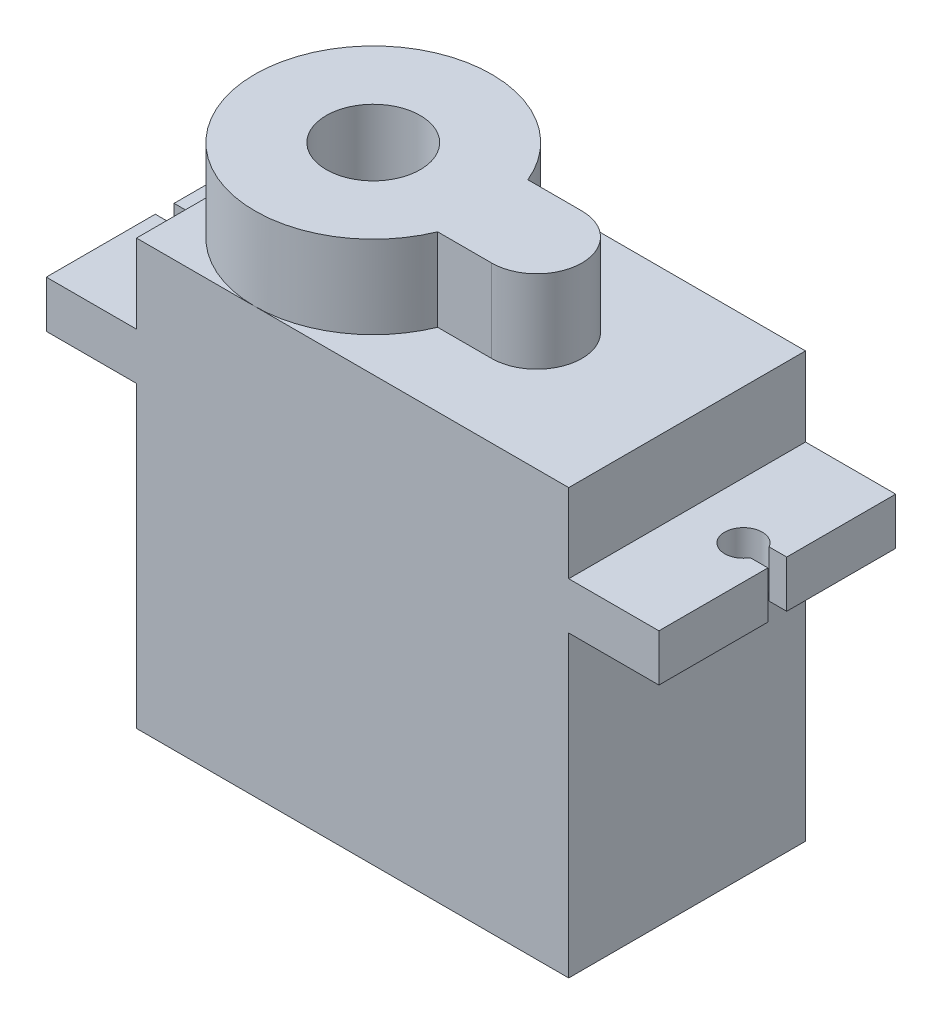
ISO-10303-21;
HEADER;
FILE_DESCRIPTION(('STEP AP214'),'2;1');
FILE_NAME('part.step','',(''),(''),'','','');
FILE_SCHEMA(('AUTOMOTIVE_DESIGN { 1 0 10303 214 1 1 1 1 }'));
ENDSEC;
DATA;
#1=APPLICATION_CONTEXT('core data for automotive mechanical design processes');
#2=APPLICATION_PROTOCOL_DEFINITION('international standard','automotive_design',2000,#1);
#3=PRODUCT_CONTEXT('',#1,'mechanical');
#4=PRODUCT('Part','Part','',(#3));
#5=PRODUCT_RELATED_PRODUCT_CATEGORY('part','',(#4));
#6=PRODUCT_DEFINITION_FORMATION('','',#4);
#7=PRODUCT_DEFINITION_CONTEXT('part definition',#1,'design');
#8=PRODUCT_DEFINITION('design','',#6,#7);
#9=PRODUCT_DEFINITION_SHAPE('','',#8);
#10=(LENGTH_UNIT() NAMED_UNIT(*) SI_UNIT(.MILLI.,.METRE.));
#11=(NAMED_UNIT(*) PLANE_ANGLE_UNIT() SI_UNIT($,.RADIAN.));
#12=(NAMED_UNIT(*) SI_UNIT($,.STERADIAN.) SOLID_ANGLE_UNIT());
#13=UNCERTAINTY_MEASURE_WITH_UNIT(LENGTH_MEASURE(1.E-05),#10,'distance_accuracy_value','');
#14=(GEOMETRIC_REPRESENTATION_CONTEXT(3) GLOBAL_UNCERTAINTY_ASSIGNED_CONTEXT((#13)) GLOBAL_UNIT_ASSIGNED_CONTEXT((#10,
#11,#12)) REPRESENTATION_CONTEXT('',''));
#15=CARTESIAN_POINT('',(0.,0.,0.));
#16=DIRECTION('',(0.,0.,1.));
#17=DIRECTION('',(1.,0.,0.));
#18=AXIS2_PLACEMENT_3D('',#15,#16,#17);
#19=CARTESIAN_POINT('',(-11.5,22.6,12.6));
#20=DIRECTION('',(0.,1.,0.));
#21=DIRECTION('',(0.,0.,1.));
#22=AXIS2_PLACEMENT_3D('',#19,#20,#21);
#23=PLANE('',#22);
#24=CARTESIAN_POINT('',(-5.2,22.6,6.3));
#25=DIRECTION('',(0.,1.,0.));
#26=DIRECTION('',(0.,0.,1.));
#27=AXIS2_PLACEMENT_3D('',#24,#25,#26);
#28=CIRCLE('',#27,6.3);
#29=CARTESIAN_POINT('',(0.624946351684278,22.6,3.9));
#30=VERTEX_POINT('',#29);
#31=CARTESIAN_POINT('',(-5.2,22.6,0.));
#32=VERTEX_POINT('',#31);
#33=EDGE_CURVE('E47',#30,#32,#28,.T.);
#34=ORIENTED_EDGE('',*,*,#33,.F.);
#35=DIRECTION('',(1.,0.,0.));
#36=VECTOR('',#35,1.);
#37=CARTESIAN_POINT('',(0.,22.6,3.9));
#38=LINE('',#37,#36);
#39=CARTESIAN_POINT('',(3.5,22.6,3.9));
#40=VERTEX_POINT('',#39);
#41=EDGE_CURVE('E58',#30,#40,#38,.T.);
#42=ORIENTED_EDGE('',*,*,#41,.T.);
#43=CARTESIAN_POINT('',(3.5,22.6,6.3));
#44=DIRECTION('',(0.,1.,0.));
#45=DIRECTION('',(0.,0.,1.));
#46=AXIS2_PLACEMENT_3D('',#43,#44,#45);
#47=CIRCLE('',#46,2.4);
#48=CARTESIAN_POINT('',(3.5,22.6,8.7));
#49=VERTEX_POINT('',#48);
#50=EDGE_CURVE('E444',#49,#40,#47,.T.);
#51=ORIENTED_EDGE('',*,*,#50,.F.);
#52=DIRECTION('',(1.,0.,0.));
#53=VECTOR('',#52,1.);
#54=CARTESIAN_POINT('',(0.,22.6,8.7));
#55=LINE('',#54,#53);
#56=CARTESIAN_POINT('',(0.624946351684278,22.6,8.7));
#57=VERTEX_POINT('',#56);
#58=EDGE_CURVE('E443',#57,#49,#55,.T.);
#59=ORIENTED_EDGE('',*,*,#58,.F.);
#60=CARTESIAN_POINT('',(-5.2,22.6,12.6));
#61=VERTEX_POINT('',#60);
#62=EDGE_CURVE('E233',#61,#57,#28,.T.);
#63=ORIENTED_EDGE('',*,*,#62,.F.);
#64=DIRECTION('',(1.,0.,0.));
#65=VECTOR('',#64,1.);
#66=CARTESIAN_POINT('',(-11.5,22.6,12.6));
#67=LINE('',#66,#65);
#68=CARTESIAN_POINT('',(11.5,22.6,12.6));
#69=VERTEX_POINT('',#68);
#70=EDGE_CURVE('E311',#61,#69,#67,.T.);
#71=ORIENTED_EDGE('',*,*,#70,.T.);
#72=DIRECTION('',(0.,0.,-1.));
#73=VECTOR('',#72,1.);
#74=CARTESIAN_POINT('',(11.5,22.6,12.6));
#75=LINE('',#74,#73);
#76=CARTESIAN_POINT('',(11.5,22.6,0.));
#77=VERTEX_POINT('',#76);
#78=EDGE_CURVE('E375',#69,#77,#75,.T.);
#79=ORIENTED_EDGE('',*,*,#78,.T.);
#80=DIRECTION('',(1.,0.,0.));
#81=VECTOR('',#80,1.);
#82=CARTESIAN_POINT('',(-11.5,22.6,0.));
#83=LINE('',#82,#81);
#84=EDGE_CURVE('E343',#32,#77,#83,.T.);
#85=ORIENTED_EDGE('',*,*,#84,.F.);
#86=EDGE_LOOP('',(#34,#42,#51,#59,#63,#71,#79,#85));
#87=FACE_BOUND('',#86,.T.);
#88=ADVANCED_FACE('F36',(#87),#23,.T.);
#89=CARTESIAN_POINT('',(-11.5,22.6,6.3));
#90=VERTEX_POINT('',#89);
#91=EDGE_CURVE('E11',#32,#90,#28,.T.);
#92=ORIENTED_EDGE('',*,*,#91,.F.);
#93=CARTESIAN_POINT('',(-11.5,22.6,0.));
#94=VERTEX_POINT('',#93);
#95=EDGE_CURVE('E344',#94,#32,#83,.T.);
#96=ORIENTED_EDGE('',*,*,#95,.F.);
#97=DIRECTION('',(0.,0.,-1.));
#98=VECTOR('',#97,1.);
#99=CARTESIAN_POINT('',(-11.5,22.6,12.6));
#100=LINE('',#99,#98);
#101=EDGE_CURVE('E381',#90,#94,#100,.T.);
#102=ORIENTED_EDGE('',*,*,#101,.F.);
#103=EDGE_LOOP('',(#92,#96,#102));
#104=FACE_BOUND('',#103,.T.);
#105=ADVANCED_FACE('F450',(#104),#23,.T.);
#106=CARTESIAN_POINT('',(-16.3,18.4,12.6));
#107=DIRECTION('',(0.,1.,0.));
#108=DIRECTION('',(0.,0.,1.));
#109=AXIS2_PLACEMENT_3D('',#106,#107,#108);
#110=PLANE('',#109);
#111=DIRECTION('',(1.,0.,0.));
#112=VECTOR('',#111,1.);
#113=CARTESIAN_POINT('',(0.,18.4,6.8));
#114=LINE('',#113,#112);
#115=CARTESIAN_POINT('',(-16.3,18.4,6.8));
#116=VERTEX_POINT('',#115);
#117=CARTESIAN_POINT('',(-15.3660254037844,18.4,6.8));
#118=VERTEX_POINT('',#117);
#119=EDGE_CURVE('E234',#116,#118,#114,.T.);
#120=ORIENTED_EDGE('',*,*,#119,.F.);
#121=DIRECTION('',(0.,0.,-1.));
#122=VECTOR('',#121,1.);
#123=CARTESIAN_POINT('',(-16.3,18.4,12.6));
#124=LINE('',#123,#122);
#125=CARTESIAN_POINT('',(-16.3,18.4,12.6));
#126=VERTEX_POINT('',#125);
#127=EDGE_CURVE('E384',#126,#116,#124,.T.);
#128=ORIENTED_EDGE('',*,*,#127,.F.);
#129=DIRECTION('',(1.,0.,0.));
#130=VECTOR('',#129,1.);
#131=CARTESIAN_POINT('',(-16.3,18.4,12.6));
#132=LINE('',#131,#130);
#133=CARTESIAN_POINT('',(-11.5,18.4,12.6));
#134=VERTEX_POINT('',#133);
#135=EDGE_CURVE('E305',#126,#134,#132,.T.);
#136=ORIENTED_EDGE('',*,*,#135,.T.);
#137=DIRECTION('',(0.,0.,-1.));
#138=VECTOR('',#137,1.);
#139=CARTESIAN_POINT('',(-11.5,18.4,12.6));
#140=LINE('',#139,#138);
#141=CARTESIAN_POINT('',(-11.5,18.4,0.));
#142=VERTEX_POINT('',#141);
#143=EDGE_CURVE('E382',#134,#142,#140,.T.);
#144=ORIENTED_EDGE('',*,*,#143,.T.);
#145=DIRECTION('',(1.,0.,0.));
#146=VECTOR('',#145,1.);
#147=CARTESIAN_POINT('',(-16.3,18.4,0.));
#148=LINE('',#147,#146);
#149=CARTESIAN_POINT('',(-16.3,18.4,0.));
#150=VERTEX_POINT('',#149);
#151=EDGE_CURVE('E337',#150,#142,#148,.T.);
#152=ORIENTED_EDGE('',*,*,#151,.F.);
#153=CARTESIAN_POINT('',(-16.3,18.4,5.8));
#154=VERTEX_POINT('',#153);
#155=EDGE_CURVE('E387',#154,#150,#124,.T.);
#156=ORIENTED_EDGE('',*,*,#155,.F.);
#157=DIRECTION('',(1.,0.,0.));
#158=VECTOR('',#157,1.);
#159=CARTESIAN_POINT('',(0.,18.4,5.8));
#160=LINE('',#159,#158);
#161=CARTESIAN_POINT('',(-15.3660254037844,18.4,5.8));
#162=VERTEX_POINT('',#161);
#163=EDGE_CURVE('E247',#154,#162,#160,.T.);
#164=ORIENTED_EDGE('',*,*,#163,.T.);
#165=CARTESIAN_POINT('',(-14.5,18.4,6.3));
#166=DIRECTION('',(0.,1.,0.));
#167=DIRECTION('',(0.,0.,1.));
#168=AXIS2_PLACEMENT_3D('',#165,#166,#167);
#169=CIRCLE('',#168,1.);
#170=EDGE_CURVE('E237',#162,#118,#169,.F.);
#171=ORIENTED_EDGE('',*,*,#170,.T.);
#172=EDGE_LOOP('',(#120,#128,#136,#144,#152,#156,#164,#171));
#173=FACE_BOUND('',#172,.T.);
#174=ADVANCED_FACE('F433',(#173),#110,.T.);
#175=CARTESIAN_POINT('',(-16.3,15.9,12.6));
#176=DIRECTION('',(-1.,0.,0.));
#177=DIRECTION('',(0.,-1.,0.));
#178=AXIS2_PLACEMENT_3D('',#175,#176,#177);
#179=PLANE('',#178);
#180=DIRECTION('',(0.,0.,-1.));
#181=VECTOR('',#180,1.);
#182=CARTESIAN_POINT('',(-16.3,15.9,12.6));
#183=LINE('',#182,#181);
#184=CARTESIAN_POINT('',(-16.3,15.9,5.8));
#185=VERTEX_POINT('',#184);
#186=CARTESIAN_POINT('',(-16.3,15.9,0.));
#187=VERTEX_POINT('',#186);
#188=EDGE_CURVE('E390',#185,#187,#183,.T.);
#189=ORIENTED_EDGE('',*,*,#188,.F.);
#190=DIRECTION('',(0.,1.,0.));
#191=VECTOR('',#190,1.);
#192=CARTESIAN_POINT('',(-16.3,15.9,5.8));
#193=LINE('',#192,#191);
#194=EDGE_CURVE('E260',#185,#154,#193,.T.);
#195=ORIENTED_EDGE('',*,*,#194,.T.);
#196=ORIENTED_EDGE('',*,*,#155,.T.);
#197=DIRECTION('',(0.,1.,0.));
#198=VECTOR('',#197,1.);
#199=CARTESIAN_POINT('',(-16.3,15.9,0.));
#200=LINE('',#199,#198);
#201=EDGE_CURVE('E334',#187,#150,#200,.T.);
#202=ORIENTED_EDGE('',*,*,#201,.F.);
#203=EDGE_LOOP('',(#189,#195,#196,#202));
#204=FACE_BOUND('',#203,.T.);
#205=ADVANCED_FACE('F429',(#204),#179,.T.);
#206=CARTESIAN_POINT('',(-11.5,15.9,12.6));
#207=DIRECTION('',(0.,-1.,0.));
#208=DIRECTION('',(0.,0.,-1.));
#209=AXIS2_PLACEMENT_3D('',#206,#207,#208);
#210=PLANE('',#209);
#211=DIRECTION('',(1.,0.,0.));
#212=VECTOR('',#211,1.);
#213=CARTESIAN_POINT('',(0.,15.9,6.8));
#214=LINE('',#213,#212);
#215=CARTESIAN_POINT('',(-16.3,15.9,6.8));
#216=VERTEX_POINT('',#215);
#217=CARTESIAN_POINT('',(-15.3660254037844,15.9,6.8));
#218=VERTEX_POINT('',#217);
#219=EDGE_CURVE('E243',#216,#218,#214,.T.);
#220=ORIENTED_EDGE('',*,*,#219,.T.);
#221=CARTESIAN_POINT('',(-14.5,15.9,6.3));
#222=DIRECTION('',(0.,1.,0.));
#223=DIRECTION('',(0.,0.,1.));
#224=AXIS2_PLACEMENT_3D('',#221,#222,#223);
#225=CIRCLE('',#224,1.);
#226=CARTESIAN_POINT('',(-15.3660254037844,15.9,5.8));
#227=VERTEX_POINT('',#226);
#228=EDGE_CURVE('E246',#227,#218,#225,.F.);
#229=ORIENTED_EDGE('',*,*,#228,.F.);
#230=DIRECTION('',(1.,0.,0.));
#231=VECTOR('',#230,1.);
#232=CARTESIAN_POINT('',(0.,15.9,5.8));
#233=LINE('',#232,#231);
#234=EDGE_CURVE('E249',#185,#227,#233,.T.);
#235=ORIENTED_EDGE('',*,*,#234,.F.);
#236=ORIENTED_EDGE('',*,*,#188,.T.);
#237=DIRECTION('',(-1.,0.,0.));
#238=VECTOR('',#237,1.);
#239=CARTESIAN_POINT('',(-11.5,15.9,0.));
#240=LINE('',#239,#238);
#241=CARTESIAN_POINT('',(-11.5,15.9,0.));
#242=VERTEX_POINT('',#241);
#243=EDGE_CURVE('E331',#242,#187,#240,.T.);
#244=ORIENTED_EDGE('',*,*,#243,.F.);
#245=DIRECTION('',(0.,0.,-1.));
#246=VECTOR('',#245,1.);
#247=CARTESIAN_POINT('',(-11.5,15.9,12.6));
#248=LINE('',#247,#246);
#249=CARTESIAN_POINT('',(-11.5,15.9,12.6));
#250=VERTEX_POINT('',#249);
#251=EDGE_CURVE('E391',#250,#242,#248,.T.);
#252=ORIENTED_EDGE('',*,*,#251,.F.);
#253=DIRECTION('',(-1.,0.,0.));
#254=VECTOR('',#253,1.);
#255=CARTESIAN_POINT('',(-11.5,15.9,12.6));
#256=LINE('',#255,#254);
#257=CARTESIAN_POINT('',(-16.3,15.9,12.6));
#258=VERTEX_POINT('',#257);
#259=EDGE_CURVE('E299',#250,#258,#256,.T.);
#260=ORIENTED_EDGE('',*,*,#259,.T.);
#261=EDGE_CURVE('E388',#258,#216,#183,.T.);
#262=ORIENTED_EDGE('',*,*,#261,.T.);
#263=EDGE_LOOP('',(#220,#229,#235,#236,#244,#252,#260,#262));
#264=FACE_BOUND('',#263,.T.);
#265=ADVANCED_FACE('F423',(#264),#210,.T.);
#266=CARTESIAN_POINT('',(16.3,15.9,12.6));
#267=DIRECTION('',(-1.,0.,0.));
#268=DIRECTION('',(0.,-1.,0.));
#269=AXIS2_PLACEMENT_3D('',#266,#267,#268);
#270=PLANE('',#269);
#271=DIRECTION('',(0.,1.,0.));
#272=VECTOR('',#271,1.);
#273=CARTESIAN_POINT('',(16.3,15.9,6.8));
#274=LINE('',#273,#272);
#275=CARTESIAN_POINT('',(16.3,15.9,6.8));
#276=VERTEX_POINT('',#275);
#277=CARTESIAN_POINT('',(16.3,18.4,6.8));
#278=VERTEX_POINT('',#277);
#279=EDGE_CURVE('E285',#276,#278,#274,.T.);
#280=ORIENTED_EDGE('',*,*,#279,.T.);
#281=DIRECTION('',(0.,0.,-1.));
#282=VECTOR('',#281,1.);
#283=CARTESIAN_POINT('',(16.3,18.4,12.6));
#284=LINE('',#283,#282);
#285=CARTESIAN_POINT('',(16.3,18.4,12.6));
#286=VERTEX_POINT('',#285);
#287=EDGE_CURVE('E368',#286,#278,#284,.T.);
#288=ORIENTED_EDGE('',*,*,#287,.F.);
#289=DIRECTION('',(0.,1.,0.));
#290=VECTOR('',#289,1.);
#291=CARTESIAN_POINT('',(16.3,15.9,12.6));
#292=LINE('',#291,#290);
#293=CARTESIAN_POINT('',(16.3,15.9,12.6));
#294=VERTEX_POINT('',#293);
#295=EDGE_CURVE('E320',#294,#286,#292,.T.);
#296=ORIENTED_EDGE('',*,*,#295,.F.);
#297=DIRECTION('',(0.,0.,-1.));
#298=VECTOR('',#297,1.);
#299=CARTESIAN_POINT('',(16.3,15.9,12.6));
#300=LINE('',#299,#298);
#301=EDGE_CURVE('E364',#294,#276,#300,.T.);
#302=ORIENTED_EDGE('',*,*,#301,.T.);
#303=EDGE_LOOP('',(#280,#288,#296,#302));
#304=FACE_BOUND('',#303,.T.);
#305=ADVANCED_FACE('F654',(#304),#270,.F.);
#306=CARTESIAN_POINT('',(11.5,0.,12.6));
#307=DIRECTION('',(0.,-1.,0.));
#308=DIRECTION('',(0.,0.,-1.));
#309=AXIS2_PLACEMENT_3D('',#306,#307,#308);
#310=PLANE('',#309);
#311=DIRECTION('',(-1.,0.,0.));
#312=VECTOR('',#311,1.);
#313=CARTESIAN_POINT('',(11.5,0.,0.));
#314=LINE('',#313,#312);
#315=CARTESIAN_POINT('',(11.5,0.,0.));
#316=VERTEX_POINT('',#315);
#317=CARTESIAN_POINT('',(-11.5,0.,0.));
#318=VERTEX_POINT('',#317);
#319=EDGE_CURVE('E284',#316,#318,#314,.T.);
#320=ORIENTED_EDGE('',*,*,#319,.F.);
#321=DIRECTION('',(0.,0.,-1.));
#322=VECTOR('',#321,1.);
#323=CARTESIAN_POINT('',(11.5,0.,12.6));
#324=LINE('',#323,#322);
#325=CARTESIAN_POINT('',(11.5,0.,12.6));
#326=VERTEX_POINT('',#325);
#327=EDGE_CURVE('E359',#326,#316,#324,.T.);
#328=ORIENTED_EDGE('',*,*,#327,.F.);
#329=DIRECTION('',(-1.,0.,0.));
#330=VECTOR('',#329,1.);
#331=CARTESIAN_POINT('',(11.5,0.,12.6));
#332=LINE('',#331,#330);
#333=CARTESIAN_POINT('',(-11.5,0.,12.6));
#334=VERTEX_POINT('',#333);
#335=EDGE_CURVE('E292',#326,#334,#332,.T.);
#336=ORIENTED_EDGE('',*,*,#335,.T.);
#337=DIRECTION('',(0.,0.,-1.));
#338=VECTOR('',#337,1.);
#339=CARTESIAN_POINT('',(-11.5,0.,12.6));
#340=LINE('',#339,#338);
#341=EDGE_CURVE('E40',#334,#318,#340,.T.);
#342=ORIENTED_EDGE('',*,*,#341,.T.);
#343=EDGE_LOOP('',(#320,#328,#336,#342));
#344=FACE_BOUND('',#343,.T.);
#345=ADVANCED_FACE('F38',(#344),#310,.T.);
#346=CARTESIAN_POINT('',(11.5,0.,12.6));
#347=DIRECTION('',(-1.,0.,0.));
#348=DIRECTION('',(0.,0.,1.));
#349=AXIS2_PLACEMENT_3D('',#346,#347,#348);
#350=PLANE('',#349);
#351=DIRECTION('',(0.,1.,0.));
#352=VECTOR('',#351,1.);
#353=CARTESIAN_POINT('',(11.5,0.,0.));
#354=LINE('',#353,#352);
#355=CARTESIAN_POINT('',(11.5,15.9,0.));
#356=VERTEX_POINT('',#355);
#357=EDGE_CURVE('E296',#316,#356,#354,.T.);
#358=ORIENTED_EDGE('',*,*,#357,.T.);
#359=DIRECTION('',(0.,0.,-1.));
#360=VECTOR('',#359,1.);
#361=CARTESIAN_POINT('',(11.5,15.9,12.6));
#362=LINE('',#361,#360);
#363=CARTESIAN_POINT('',(11.5,15.9,12.6));
#364=VERTEX_POINT('',#363);
#365=EDGE_CURVE('E361',#364,#356,#362,.T.);
#366=ORIENTED_EDGE('',*,*,#365,.F.);
#367=DIRECTION('',(0.,1.,0.));
#368=VECTOR('',#367,1.);
#369=CARTESIAN_POINT('',(11.5,0.,12.6));
#370=LINE('',#369,#368);
#371=EDGE_CURVE('E324',#326,#364,#370,.T.);
#372=ORIENTED_EDGE('',*,*,#371,.F.);
#373=ORIENTED_EDGE('',*,*,#327,.T.);
#374=EDGE_LOOP('',(#358,#366,#372,#373));
#375=FACE_BOUND('',#374,.T.);
#376=ADVANCED_FACE('F407',(#375),#350,.F.);
#377=CARTESIAN_POINT('',(11.5,15.9,12.6));
#378=DIRECTION('',(0.,1.,0.));
#379=DIRECTION('',(0.,0.,1.));
#380=AXIS2_PLACEMENT_3D('',#377,#378,#379);
#381=PLANE('',#380);
#382=CARTESIAN_POINT('',(16.3,15.9,5.8));
#383=VERTEX_POINT('',#382);
#384=CARTESIAN_POINT('',(16.3,15.9,0.));
#385=VERTEX_POINT('',#384);
#386=EDGE_CURVE('E367',#383,#385,#300,.T.);
#387=ORIENTED_EDGE('',*,*,#386,.F.);
#388=DIRECTION('',(-1.,0.,0.));
#389=VECTOR('',#388,1.);
#390=CARTESIAN_POINT('',(0.,15.9,5.79999999999994));
#391=LINE('',#390,#389);
#392=CARTESIAN_POINT('',(15.3660254037844,15.9,5.8));
#393=VERTEX_POINT('',#392);
#394=EDGE_CURVE('E266',#383,#393,#391,.T.);
#395=ORIENTED_EDGE('',*,*,#394,.T.);
#396=CARTESIAN_POINT('',(14.5,15.9,6.3));
#397=DIRECTION('',(0.,1.,0.));
#398=DIRECTION('',(0.,0.,1.));
#399=AXIS2_PLACEMENT_3D('',#396,#397,#398);
#400=CIRCLE('',#399,1.);
#401=CARTESIAN_POINT('',(15.3660254037844,15.9,6.8));
#402=VERTEX_POINT('',#401);
#403=EDGE_CURVE('E269',#393,#402,#400,.T.);
#404=ORIENTED_EDGE('',*,*,#403,.T.);
#405=DIRECTION('',(-1.,0.,0.));
#406=VECTOR('',#405,1.);
#407=CARTESIAN_POINT('',(0.,15.9,6.80000000000006));
#408=LINE('',#407,#406);
#409=EDGE_CURVE('E273',#276,#402,#408,.T.);
#410=ORIENTED_EDGE('',*,*,#409,.F.);
#411=ORIENTED_EDGE('',*,*,#301,.F.);
#412=DIRECTION('',(1.,0.,0.));
#413=VECTOR('',#412,1.);
#414=CARTESIAN_POINT('',(11.5,15.9,12.6));
#415=LINE('',#414,#413);
#416=EDGE_CURVE('E322',#364,#294,#415,.T.);
#417=ORIENTED_EDGE('',*,*,#416,.F.);
#418=ORIENTED_EDGE('',*,*,#365,.T.);
#419=DIRECTION('',(1.,0.,0.));
#420=VECTOR('',#419,1.);
#421=CARTESIAN_POINT('',(11.5,15.9,0.));
#422=LINE('',#421,#420);
#423=EDGE_CURVE('E355',#356,#385,#422,.T.);
#424=ORIENTED_EDGE('',*,*,#423,.T.);
#425=EDGE_LOOP('',(#387,#395,#404,#410,#411,#417,#418,#424));
#426=FACE_BOUND('',#425,.T.);
#427=ADVANCED_FACE('F412',(#426),#381,.F.);
#428=CARTESIAN_POINT('',(16.3,18.4,5.8));
#429=VERTEX_POINT('',#428);
#430=CARTESIAN_POINT('',(16.3,18.4,0.));
#431=VERTEX_POINT('',#430);
#432=EDGE_CURVE('E371',#429,#431,#284,.T.);
#433=ORIENTED_EDGE('',*,*,#432,.F.);
#434=DIRECTION('',(0.,1.,0.));
#435=VECTOR('',#434,1.);
#436=CARTESIAN_POINT('',(16.3,15.9,5.8));
#437=LINE('',#436,#435);
#438=EDGE_CURVE('E282',#383,#429,#437,.T.);
#439=ORIENTED_EDGE('',*,*,#438,.F.);
#440=ORIENTED_EDGE('',*,*,#386,.T.);
#441=DIRECTION('',(0.,1.,0.));
#442=VECTOR('',#441,1.);
#443=CARTESIAN_POINT('',(16.3,15.9,0.));
#444=LINE('',#443,#442);
#445=EDGE_CURVE('E352',#385,#431,#444,.T.);
#446=ORIENTED_EDGE('',*,*,#445,.T.);
#447=EDGE_LOOP('',(#433,#439,#440,#446));
#448=FACE_BOUND('',#447,.T.);
#449=ADVANCED_FACE('F642',(#448),#270,.F.);
#450=CARTESIAN_POINT('',(16.3,18.4,12.6));
#451=DIRECTION('',(0.,-1.,0.));
#452=DIRECTION('',(0.,0.,-1.));
#453=AXIS2_PLACEMENT_3D('',#450,#451,#452);
#454=PLANE('',#453);
#455=CARTESIAN_POINT('',(14.5,18.4,6.3));
#456=DIRECTION('',(0.,1.,0.));
#457=DIRECTION('',(0.,0.,1.));
#458=AXIS2_PLACEMENT_3D('',#455,#456,#457);
#459=CIRCLE('',#458,1.);
#460=CARTESIAN_POINT('',(15.3660254037844,18.4,5.8));
#461=VERTEX_POINT('',#460);
#462=CARTESIAN_POINT('',(15.3660254037844,18.4,6.8));
#463=VERTEX_POINT('',#462);
#464=EDGE_CURVE('E277',#461,#463,#459,.T.);
#465=ORIENTED_EDGE('',*,*,#464,.F.);
#466=DIRECTION('',(-1.,0.,0.));
#467=VECTOR('',#466,1.);
#468=CARTESIAN_POINT('',(0.,18.4,5.79999999999994));
#469=LINE('',#468,#467);
#470=EDGE_CURVE('E259',#429,#461,#469,.T.);
#471=ORIENTED_EDGE('',*,*,#470,.F.);
#472=ORIENTED_EDGE('',*,*,#432,.T.);
#473=DIRECTION('',(-1.,0.,0.));
#474=VECTOR('',#473,1.);
#475=CARTESIAN_POINT('',(16.3,18.4,0.));
#476=LINE('',#475,#474);
#477=CARTESIAN_POINT('',(11.5,18.4,0.));
#478=VERTEX_POINT('',#477);
#479=EDGE_CURVE('E350',#431,#478,#476,.T.);
#480=ORIENTED_EDGE('',*,*,#479,.T.);
#481=DIRECTION('',(0.,0.,-1.));
#482=VECTOR('',#481,1.);
#483=CARTESIAN_POINT('',(11.5,18.4,12.6));
#484=LINE('',#483,#482);
#485=CARTESIAN_POINT('',(11.5,18.4,12.6));
#486=VERTEX_POINT('',#485);
#487=EDGE_CURVE('E372',#486,#478,#484,.T.);
#488=ORIENTED_EDGE('',*,*,#487,.F.);
#489=DIRECTION('',(-1.,0.,0.));
#490=VECTOR('',#489,1.);
#491=CARTESIAN_POINT('',(16.3,18.4,12.6));
#492=LINE('',#491,#490);
#493=EDGE_CURVE('E318',#286,#486,#492,.T.);
#494=ORIENTED_EDGE('',*,*,#493,.F.);
#495=ORIENTED_EDGE('',*,*,#287,.T.);
#496=DIRECTION('',(-1.,0.,0.));
#497=VECTOR('',#496,1.);
#498=CARTESIAN_POINT('',(0.,18.4,6.80000000000006));
#499=LINE('',#498,#497);
#500=EDGE_CURVE('E270',#278,#463,#499,.T.);
#501=ORIENTED_EDGE('',*,*,#500,.T.);
#502=EDGE_LOOP('',(#465,#471,#472,#480,#488,#494,#495,#501));
#503=FACE_BOUND('',#502,.T.);
#504=ADVANCED_FACE('F498',(#503),#454,.F.);
#505=CARTESIAN_POINT('',(11.5,18.4,12.6));
#506=DIRECTION('',(-1.,0.,0.));
#507=DIRECTION('',(0.,0.,1.));
#508=AXIS2_PLACEMENT_3D('',#505,#506,#507);
#509=PLANE('',#508);
#510=DIRECTION('',(0.,1.,0.));
#511=VECTOR('',#510,1.);
#512=CARTESIAN_POINT('',(11.5,18.4,0.));
#513=LINE('',#512,#511);
#514=EDGE_CURVE('E347',#478,#77,#513,.T.);
#515=ORIENTED_EDGE('',*,*,#514,.T.);
#516=ORIENTED_EDGE('',*,*,#78,.F.);
#517=DIRECTION('',(0.,1.,0.));
#518=VECTOR('',#517,1.);
#519=CARTESIAN_POINT('',(11.5,18.4,12.6));
#520=LINE('',#519,#518);
#521=EDGE_CURVE('E315',#486,#69,#520,.T.);
#522=ORIENTED_EDGE('',*,*,#521,.F.);
#523=ORIENTED_EDGE('',*,*,#487,.T.);
#524=EDGE_LOOP('',(#515,#516,#522,#523));
#525=FACE_BOUND('',#524,.T.);
#526=ADVANCED_FACE('F492',(#525),#509,.F.);
#527=EDGE_CURVE('E45',#90,#61,#28,.T.);
#528=ORIENTED_EDGE('',*,*,#527,.F.);
#529=CARTESIAN_POINT('',(-11.5,22.6,12.6));
#530=VERTEX_POINT('',#529);
#531=EDGE_CURVE('E378',#530,#90,#100,.T.);
#532=ORIENTED_EDGE('',*,*,#531,.F.);
#533=EDGE_CURVE('E312',#530,#61,#67,.T.);
#534=ORIENTED_EDGE('',*,*,#533,.T.);
#535=EDGE_LOOP('',(#528,#532,#534));
#536=FACE_BOUND('',#535,.T.);
#537=ADVANCED_FACE('F448',(#536),#23,.T.);
#538=CARTESIAN_POINT('',(-11.5,18.4,12.6));
#539=DIRECTION('',(-1.,0.,0.));
#540=DIRECTION('',(0.,0.,1.));
#541=AXIS2_PLACEMENT_3D('',#538,#539,#540);
#542=PLANE('',#541);
#543=DIRECTION('',(0.,1.,0.));
#544=VECTOR('',#543,1.);
#545=CARTESIAN_POINT('',(-11.5,18.4,0.));
#546=LINE('',#545,#544);
#547=EDGE_CURVE('E340',#142,#94,#546,.T.);
#548=ORIENTED_EDGE('',*,*,#547,.F.);
#549=ORIENTED_EDGE('',*,*,#143,.F.);
#550=DIRECTION('',(0.,1.,0.));
#551=VECTOR('',#550,1.);
#552=CARTESIAN_POINT('',(-11.5,18.4,12.6));
#553=LINE('',#552,#551);
#554=EDGE_CURVE('E308',#134,#530,#553,.T.);
#555=ORIENTED_EDGE('',*,*,#554,.T.);
#556=ORIENTED_EDGE('',*,*,#531,.T.);
#557=ORIENTED_EDGE('',*,*,#101,.T.);
#558=EDGE_LOOP('',(#548,#549,#555,#556,#557));
#559=FACE_BOUND('',#558,.T.);
#560=ADVANCED_FACE('F437',(#559),#542,.T.);
#561=DIRECTION('',(0.,1.,0.));
#562=VECTOR('',#561,1.);
#563=CARTESIAN_POINT('',(-16.3,15.9,6.8));
#564=LINE('',#563,#562);
#565=EDGE_CURVE('E257',#216,#116,#564,.T.);
#566=ORIENTED_EDGE('',*,*,#565,.F.);
#567=ORIENTED_EDGE('',*,*,#261,.F.);
#568=DIRECTION('',(0.,1.,0.));
#569=VECTOR('',#568,1.);
#570=CARTESIAN_POINT('',(-16.3,15.9,12.6));
#571=LINE('',#570,#569);
#572=EDGE_CURVE('E302',#258,#126,#571,.T.);
#573=ORIENTED_EDGE('',*,*,#572,.T.);
#574=ORIENTED_EDGE('',*,*,#127,.T.);
#575=EDGE_LOOP('',(#566,#567,#573,#574));
#576=FACE_BOUND('',#575,.T.);
#577=ADVANCED_FACE('F497',(#576),#179,.T.);
#578=CARTESIAN_POINT('',(-11.5,0.,12.6));
#579=DIRECTION('',(-1.,0.,0.));
#580=DIRECTION('',(0.,0.,1.));
#581=AXIS2_PLACEMENT_3D('',#578,#579,#580);
#582=PLANE('',#581);
#583=DIRECTION('',(0.,1.,0.));
#584=VECTOR('',#583,1.);
#585=CARTESIAN_POINT('',(-11.5,0.,0.));
#586=LINE('',#585,#584);
#587=EDGE_CURVE('E328',#318,#242,#586,.T.);
#588=ORIENTED_EDGE('',*,*,#587,.F.);
#589=ORIENTED_EDGE('',*,*,#341,.F.);
#590=DIRECTION('',(0.,1.,0.));
#591=VECTOR('',#590,1.);
#592=CARTESIAN_POINT('',(-11.5,0.,12.6));
#593=LINE('',#592,#591);
#594=EDGE_CURVE('E295',#334,#250,#593,.T.);
#595=ORIENTED_EDGE('',*,*,#594,.T.);
#596=ORIENTED_EDGE('',*,*,#251,.T.);
#597=EDGE_LOOP('',(#588,#589,#595,#596));
#598=FACE_BOUND('',#597,.T.);
#599=ADVANCED_FACE('F399',(#598),#582,.T.);
#600=CARTESIAN_POINT('',(0.,0.,12.6));
#601=DIRECTION('',(0.,0.,-1.));
#602=DIRECTION('',(-1.,0.,0.));
#603=AXIS2_PLACEMENT_3D('',#600,#601,#602);
#604=PLANE('',#603);
#605=ORIENTED_EDGE('',*,*,#335,.F.);
#606=ORIENTED_EDGE('',*,*,#371,.T.);
#607=ORIENTED_EDGE('',*,*,#416,.T.);
#608=ORIENTED_EDGE('',*,*,#295,.T.);
#609=ORIENTED_EDGE('',*,*,#493,.T.);
#610=ORIENTED_EDGE('',*,*,#521,.T.);
#611=ORIENTED_EDGE('',*,*,#70,.F.);
#612=ORIENTED_EDGE('',*,*,#533,.F.);
#613=ORIENTED_EDGE('',*,*,#554,.F.);
#614=ORIENTED_EDGE('',*,*,#135,.F.);
#615=ORIENTED_EDGE('',*,*,#572,.F.);
#616=ORIENTED_EDGE('',*,*,#259,.F.);
#617=ORIENTED_EDGE('',*,*,#594,.F.);
#618=EDGE_LOOP('',(#605,#606,#607,#608,#609,#610,#611,#612,#613,#614,#615,#616,#617));
#619=FACE_BOUND('',#618,.T.);
#620=ADVANCED_FACE('F417',(#619),#604,.F.);
#621=CARTESIAN_POINT('',(0.,0.,0.));
#622=DIRECTION('',(0.,0.,-1.));
#623=DIRECTION('',(-1.,0.,0.));
#624=AXIS2_PLACEMENT_3D('',#621,#622,#623);
#625=PLANE('',#624);
#626=ORIENTED_EDGE('',*,*,#319,.T.);
#627=ORIENTED_EDGE('',*,*,#587,.T.);
#628=ORIENTED_EDGE('',*,*,#243,.T.);
#629=ORIENTED_EDGE('',*,*,#201,.T.);
#630=ORIENTED_EDGE('',*,*,#151,.T.);
#631=ORIENTED_EDGE('',*,*,#547,.T.);
#632=ORIENTED_EDGE('',*,*,#95,.T.);
#633=ORIENTED_EDGE('',*,*,#84,.T.);
#634=ORIENTED_EDGE('',*,*,#514,.F.);
#635=ORIENTED_EDGE('',*,*,#479,.F.);
#636=ORIENTED_EDGE('',*,*,#445,.F.);
#637=ORIENTED_EDGE('',*,*,#423,.F.);
#638=ORIENTED_EDGE('',*,*,#357,.F.);
#639=EDGE_LOOP('',(#626,#627,#628,#629,#630,#631,#632,#633,#634,#635,#636,#637,#638));
#640=FACE_BOUND('',#639,.T.);
#641=ADVANCED_FACE('F402',(#640),#625,.T.);
#642=CARTESIAN_POINT('',(0.,15.9,5.79999999999994));
#643=DIRECTION('',(0.,0.,-1.));
#644=DIRECTION('',(-1.,0.,0.));
#645=AXIS2_PLACEMENT_3D('',#642,#643,#644);
#646=PLANE('',#645);
#647=ORIENTED_EDGE('',*,*,#470,.T.);
#648=DIRECTION('',(0.,1.,0.));
#649=VECTOR('',#648,1.);
#650=CARTESIAN_POINT('',(15.3660254037844,15.9,5.8));
#651=LINE('',#650,#649);
#652=EDGE_CURVE('E275',#393,#461,#651,.T.);
#653=ORIENTED_EDGE('',*,*,#652,.F.);
#654=ORIENTED_EDGE('',*,*,#394,.F.);
#655=ORIENTED_EDGE('',*,*,#438,.T.);
#656=EDGE_LOOP('',(#647,#653,#654,#655));
#657=FACE_BOUND('',#656,.T.);
#658=ADVANCED_FACE('F516',(#657),#646,.F.);
#659=CARTESIAN_POINT('',(0.,15.9,6.80000000000006));
#660=DIRECTION('',(0.,0.,-1.));
#661=DIRECTION('',(-1.,0.,0.));
#662=AXIS2_PLACEMENT_3D('',#659,#660,#661);
#663=PLANE('',#662);
#664=ORIENTED_EDGE('',*,*,#500,.F.);
#665=ORIENTED_EDGE('',*,*,#279,.F.);
#666=ORIENTED_EDGE('',*,*,#409,.T.);
#667=DIRECTION('',(0.,1.,0.));
#668=VECTOR('',#667,1.);
#669=CARTESIAN_POINT('',(15.3660254037844,15.9,6.8));
#670=LINE('',#669,#668);
#671=EDGE_CURVE('E288',#402,#463,#670,.T.);
#672=ORIENTED_EDGE('',*,*,#671,.T.);
#673=EDGE_LOOP('',(#664,#665,#666,#672));
#674=FACE_BOUND('',#673,.T.);
#675=ADVANCED_FACE('F583',(#674),#663,.T.);
#676=CARTESIAN_POINT('',(14.5,15.9,6.3));
#677=DIRECTION('',(0.,1.,0.));
#678=DIRECTION('',(0.,0.,1.));
#679=AXIS2_PLACEMENT_3D('',#676,#677,#678);
#680=CYLINDRICAL_SURFACE('',#679,1.);
#681=ORIENTED_EDGE('',*,*,#464,.T.);
#682=ORIENTED_EDGE('',*,*,#671,.F.);
#683=ORIENTED_EDGE('',*,*,#403,.F.);
#684=ORIENTED_EDGE('',*,*,#652,.T.);
#685=EDGE_LOOP('',(#681,#682,#683,#684));
#686=FACE_BOUND('',#685,.T.);
#687=ADVANCED_FACE('F575',(#686),#680,.F.);
#688=CARTESIAN_POINT('',(0.,15.9,6.8));
#689=DIRECTION('',(0.,0.,1.));
#690=DIRECTION('',(1.,0.,0.));
#691=AXIS2_PLACEMENT_3D('',#688,#689,#690);
#692=PLANE('',#691);
#693=ORIENTED_EDGE('',*,*,#119,.T.);
#694=DIRECTION('',(0.,1.,0.));
#695=VECTOR('',#694,1.);
#696=CARTESIAN_POINT('',(-15.3660254037844,15.9,6.8));
#697=LINE('',#696,#695);
#698=EDGE_CURVE('E251',#218,#118,#697,.T.);
#699=ORIENTED_EDGE('',*,*,#698,.F.);
#700=ORIENTED_EDGE('',*,*,#219,.F.);
#701=ORIENTED_EDGE('',*,*,#565,.T.);
#702=EDGE_LOOP('',(#693,#699,#700,#701));
#703=FACE_BOUND('',#702,.T.);
#704=ADVANCED_FACE('F567',(#703),#692,.F.);
#705=CARTESIAN_POINT('',(0.,15.9,5.8));
#706=DIRECTION('',(0.,0.,1.));
#707=DIRECTION('',(1.,0.,0.));
#708=AXIS2_PLACEMENT_3D('',#705,#706,#707);
#709=PLANE('',#708);
#710=ORIENTED_EDGE('',*,*,#163,.F.);
#711=ORIENTED_EDGE('',*,*,#194,.F.);
#712=ORIENTED_EDGE('',*,*,#234,.T.);
#713=DIRECTION('',(0.,1.,0.));
#714=VECTOR('',#713,1.);
#715=CARTESIAN_POINT('',(-15.3660254037844,15.9,5.8));
#716=LINE('',#715,#714);
#717=EDGE_CURVE('E263',#227,#162,#716,.T.);
#718=ORIENTED_EDGE('',*,*,#717,.T.);
#719=EDGE_LOOP('',(#710,#711,#712,#718));
#720=FACE_BOUND('',#719,.T.);
#721=ADVANCED_FACE('F558',(#720),#709,.T.);
#722=CARTESIAN_POINT('',(-14.5,15.9,6.3));
#723=DIRECTION('',(0.,1.,0.));
#724=DIRECTION('',(0.,0.,1.));
#725=AXIS2_PLACEMENT_3D('',#722,#723,#724);
#726=CYLINDRICAL_SURFACE('',#725,1.);
#727=ORIENTED_EDGE('',*,*,#170,.F.);
#728=ORIENTED_EDGE('',*,*,#717,.F.);
#729=ORIENTED_EDGE('',*,*,#228,.T.);
#730=ORIENTED_EDGE('',*,*,#698,.T.);
#731=EDGE_LOOP('',(#727,#728,#729,#730));
#732=FACE_BOUND('',#731,.T.);
#733=ADVANCED_FACE('F549',(#732),#726,.F.);
#734=CARTESIAN_POINT('',(-5.2,27.,6.3));
#735=DIRECTION('',(0.,-1.,0.));
#736=DIRECTION('',(0.,0.,-1.));
#737=AXIS2_PLACEMENT_3D('',#734,#735,#736);
#738=CYLINDRICAL_SURFACE('',#737,6.3);
#739=ORIENTED_EDGE('',*,*,#33,.T.);
#740=ORIENTED_EDGE('',*,*,#91,.T.);
#741=ORIENTED_EDGE('',*,*,#527,.T.);
#742=ORIENTED_EDGE('',*,*,#62,.T.);
#743=DIRECTION('',(0.,-1.,0.));
#744=VECTOR('',#743,1.);
#745=CARTESIAN_POINT('',(0.624946351684278,27.,8.7));
#746=LINE('',#745,#744);
#747=CARTESIAN_POINT('',(0.624946351684278,27.,8.7));
#748=VERTEX_POINT('',#747);
#749=EDGE_CURVE('E213',#748,#57,#746,.T.);
#750=ORIENTED_EDGE('',*,*,#749,.F.);
#751=CARTESIAN_POINT('',(-5.2,27.,6.3));
#752=DIRECTION('',(0.,1.,0.));
#753=DIRECTION('',(0.,0.,1.));
#754=AXIS2_PLACEMENT_3D('',#751,#752,#753);
#755=CIRCLE('',#754,6.3);
#756=CARTESIAN_POINT('',(0.624946351684278,27.,3.9));
#757=VERTEX_POINT('',#756);
#758=EDGE_CURVE('E219',#757,#748,#755,.T.);
#759=ORIENTED_EDGE('',*,*,#758,.F.);
#760=DIRECTION('',(0.,-1.,0.));
#761=VECTOR('',#760,1.);
#762=CARTESIAN_POINT('',(0.624946351684278,27.,3.9));
#763=LINE('',#762,#761);
#764=EDGE_CURVE('E442',#757,#30,#763,.T.);
#765=ORIENTED_EDGE('',*,*,#764,.T.);
#766=EDGE_LOOP('',(#739,#740,#741,#742,#750,#759,#765));
#767=FACE_BOUND('',#766,.T.);
#768=ADVANCED_FACE('F231',(#767),#738,.T.);
#769=CARTESIAN_POINT('',(0.,27.,8.7));
#770=DIRECTION('',(0.,0.,-1.));
#771=DIRECTION('',(-1.,0.,0.));
#772=AXIS2_PLACEMENT_3D('',#769,#770,#771);
#773=PLANE('',#772);
#774=ORIENTED_EDGE('',*,*,#58,.T.);
#775=DIRECTION('',(0.,-1.,0.));
#776=VECTOR('',#775,1.);
#777=CARTESIAN_POINT('',(3.5,27.,8.7));
#778=LINE('',#777,#776);
#779=CARTESIAN_POINT('',(3.5,27.,8.7));
#780=VERTEX_POINT('',#779);
#781=EDGE_CURVE('E215',#780,#49,#778,.T.);
#782=ORIENTED_EDGE('',*,*,#781,.F.);
#783=DIRECTION('',(1.,0.,0.));
#784=VECTOR('',#783,1.);
#785=CARTESIAN_POINT('',(0.,27.,8.7));
#786=LINE('',#785,#784);
#787=EDGE_CURVE('E208',#748,#780,#786,.T.);
#788=ORIENTED_EDGE('',*,*,#787,.F.);
#789=ORIENTED_EDGE('',*,*,#749,.T.);
#790=EDGE_LOOP('',(#774,#782,#788,#789));
#791=FACE_BOUND('',#790,.T.);
#792=ADVANCED_FACE('F211',(#791),#773,.F.);
#793=CARTESIAN_POINT('',(3.5,27.,6.3));
#794=DIRECTION('',(0.,-1.,0.));
#795=DIRECTION('',(0.,0.,-1.));
#796=AXIS2_PLACEMENT_3D('',#793,#794,#795);
#797=CYLINDRICAL_SURFACE('',#796,2.4);
#798=ORIENTED_EDGE('',*,*,#50,.T.);
#799=DIRECTION('',(0.,-1.,0.));
#800=VECTOR('',#799,1.);
#801=CARTESIAN_POINT('',(3.5,27.,3.9));
#802=LINE('',#801,#800);
#803=CARTESIAN_POINT('',(3.5,27.,3.9));
#804=VERTEX_POINT('',#803);
#805=EDGE_CURVE('E239',#804,#40,#802,.T.);
#806=ORIENTED_EDGE('',*,*,#805,.F.);
#807=CARTESIAN_POINT('',(3.5,27.,6.3));
#808=DIRECTION('',(0.,1.,0.));
#809=DIRECTION('',(0.,0.,1.));
#810=AXIS2_PLACEMENT_3D('',#807,#808,#809);
#811=CIRCLE('',#810,2.4);
#812=EDGE_CURVE('E218',#780,#804,#811,.T.);
#813=ORIENTED_EDGE('',*,*,#812,.F.);
#814=ORIENTED_EDGE('',*,*,#781,.T.);
#815=EDGE_LOOP('',(#798,#806,#813,#814));
#816=FACE_BOUND('',#815,.T.);
#817=ADVANCED_FACE('F456',(#816),#797,.T.);
#818=CARTESIAN_POINT('',(0.,27.,3.9));
#819=DIRECTION('',(0.,0.,-1.));
#820=DIRECTION('',(-1.,0.,0.));
#821=AXIS2_PLACEMENT_3D('',#818,#819,#820);
#822=PLANE('',#821);
#823=ORIENTED_EDGE('',*,*,#41,.F.);
#824=ORIENTED_EDGE('',*,*,#764,.F.);
#825=DIRECTION('',(1.,0.,0.));
#826=VECTOR('',#825,1.);
#827=CARTESIAN_POINT('',(0.,27.,3.9));
#828=LINE('',#827,#826);
#829=EDGE_CURVE('E226',#757,#804,#828,.T.);
#830=ORIENTED_EDGE('',*,*,#829,.T.);
#831=ORIENTED_EDGE('',*,*,#805,.T.);
#832=EDGE_LOOP('',(#823,#824,#830,#831));
#833=FACE_BOUND('',#832,.T.);
#834=ADVANCED_FACE('F475',(#833),#822,.T.);
#835=CARTESIAN_POINT('',(-5.2,27.,6.3));
#836=DIRECTION('',(0.,-1.,0.));
#837=DIRECTION('',(0.,0.,-1.));
#838=AXIS2_PLACEMENT_3D('',#835,#836,#837);
#839=CYLINDRICAL_SURFACE('',#838,2.5);
#840=CARTESIAN_POINT('',(-5.2,27.,6.3));
#841=DIRECTION('',(0.,1.,0.));
#842=DIRECTION('',(0.,0.,1.));
#843=AXIS2_PLACEMENT_3D('',#840,#841,#842);
#844=CIRCLE('',#843,2.5);
#845=CARTESIAN_POINT('',(-5.2,27.,8.8));
#846=VERTEX_POINT('',#845);
#847=EDGE_CURVE('E459',#846,#846,#844,.T.);
#848=ORIENTED_EDGE('',*,*,#847,.T.);
#849=EDGE_LOOP('',(#848));
#850=FACE_BOUND('',#849,.T.);
#851=CARTESIAN_POINT('',(-5.2,22.6,6.3));
#852=DIRECTION('',(0.,1.,0.));
#853=DIRECTION('',(0.,0.,1.));
#854=AXIS2_PLACEMENT_3D('',#851,#852,#853);
#855=CIRCLE('',#854,2.5);
#856=CARTESIAN_POINT('',(-5.2,22.6,8.8));
#857=VERTEX_POINT('',#856);
#858=EDGE_CURVE('E228',#857,#857,#855,.T.);
#859=ORIENTED_EDGE('',*,*,#858,.F.);
#860=EDGE_LOOP('',(#859));
#861=FACE_BOUND('',#860,.T.);
#862=ADVANCED_FACE('F473',(#850,#861),#839,.F.);
#863=CARTESIAN_POINT('',(0.,27.,0.));
#864=DIRECTION('',(0.,1.,0.));
#865=DIRECTION('',(0.,0.,1.));
#866=AXIS2_PLACEMENT_3D('',#863,#864,#865);
#867=PLANE('',#866);
#868=ORIENTED_EDGE('',*,*,#758,.T.);
#869=ORIENTED_EDGE('',*,*,#787,.T.);
#870=ORIENTED_EDGE('',*,*,#812,.T.);
#871=ORIENTED_EDGE('',*,*,#829,.F.);
#872=EDGE_LOOP('',(#868,#869,#870,#871));
#873=FACE_BOUND('',#872,.T.);
#874=ORIENTED_EDGE('',*,*,#847,.F.);
#875=EDGE_LOOP('',(#874));
#876=FACE_BOUND('',#875,.T.);
#877=ADVANCED_FACE('F223',(#873,#876),#867,.T.);
#878=ORIENTED_EDGE('',*,*,#858,.T.);
#879=EDGE_LOOP('',(#878));
#880=FACE_BOUND('',#879,.T.);
#881=ADVANCED_FACE('F471',(#880),#23,.T.);
#882=CLOSED_SHELL('',(#88,#105,#174,#205,#265,#305,#345,#376,#427,#449,#504,#526,#537,#560,#577,
#599,#620,#641,#658,#675,#687,#704,#721,#733,#768,#792,#817,#834,#862,#877,#881));
#883=MANIFOLD_SOLID_BREP('B2',#882);
#884=ADVANCED_BREP_SHAPE_REPRESENTATION('',(#18,#883),#14);
#885=SHAPE_DEFINITION_REPRESENTATION(#9,#884);
ENDSEC;
END-ISO-10303-21;
